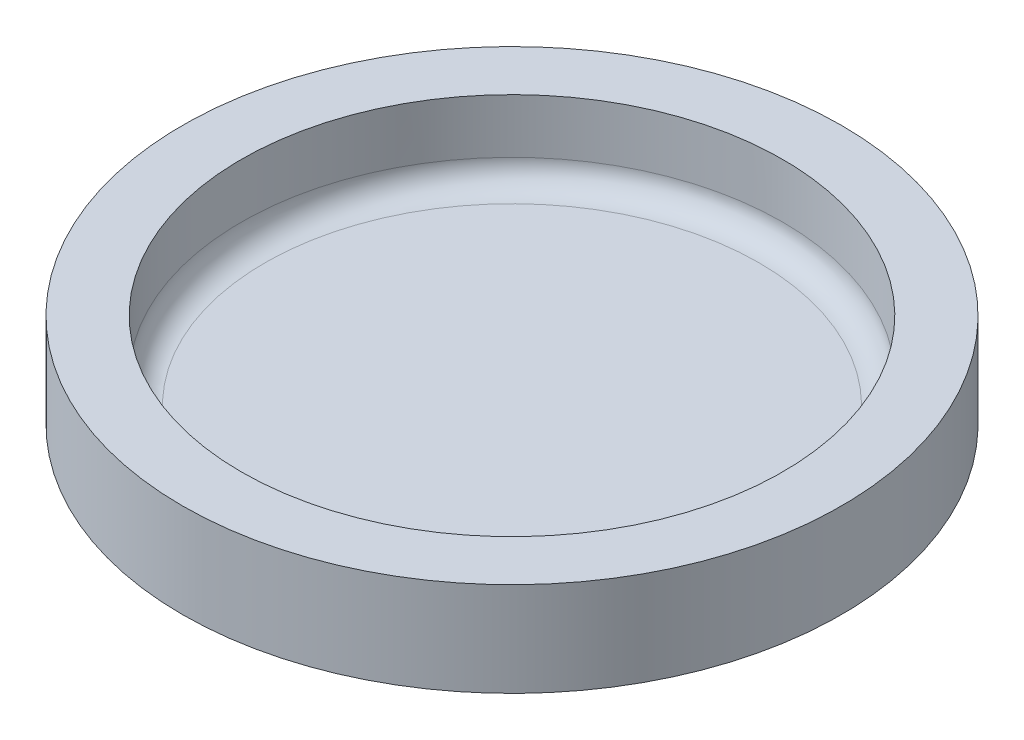
ISO-10303-21;
HEADER;
FILE_DESCRIPTION(('STEP AP214'),'2;1');
FILE_NAME('part.step','',(''),(''),'','','');
FILE_SCHEMA(('AUTOMOTIVE_DESIGN { 1 0 10303 214 1 1 1 1 }'));
ENDSEC;
DATA;
#1=APPLICATION_CONTEXT('core data for automotive mechanical design processes');
#2=APPLICATION_PROTOCOL_DEFINITION('international standard','automotive_design',2000,#1);
#3=PRODUCT_CONTEXT('',#1,'mechanical');
#4=PRODUCT('Part','Part','',(#3));
#5=PRODUCT_RELATED_PRODUCT_CATEGORY('part','',(#4));
#6=PRODUCT_DEFINITION_FORMATION('','',#4);
#7=PRODUCT_DEFINITION_CONTEXT('part definition',#1,'design');
#8=PRODUCT_DEFINITION('design','',#6,#7);
#9=PRODUCT_DEFINITION_SHAPE('','',#8);
#10=(LENGTH_UNIT() NAMED_UNIT(*) SI_UNIT(.MILLI.,.METRE.));
#11=(NAMED_UNIT(*) PLANE_ANGLE_UNIT() SI_UNIT($,.RADIAN.));
#12=(NAMED_UNIT(*) SI_UNIT($,.STERADIAN.) SOLID_ANGLE_UNIT());
#13=UNCERTAINTY_MEASURE_WITH_UNIT(LENGTH_MEASURE(1.E-05),#10,'distance_accuracy_value','');
#14=(GEOMETRIC_REPRESENTATION_CONTEXT(3) GLOBAL_UNCERTAINTY_ASSIGNED_CONTEXT((#13)) GLOBAL_UNIT_ASSIGNED_CONTEXT((#10,
#11,#12)) REPRESENTATION_CONTEXT('',''));
#15=CARTESIAN_POINT('',(0.,0.,0.));
#16=DIRECTION('',(0.,0.,1.));
#17=DIRECTION('',(1.,0.,0.));
#18=AXIS2_PLACEMENT_3D('',#15,#16,#17);
#19=CARTESIAN_POINT('',(0.,4.,0.));
#20=DIRECTION('',(0.,-1.,0.));
#21=DIRECTION('',(0.,0.,-1.));
#22=AXIS2_PLACEMENT_3D('',#19,#20,#21);
#23=CYLINDRICAL_SURFACE('',#22,14.);
#24=CARTESIAN_POINT('',(0.,4.,0.));
#25=DIRECTION('',(0.,1.,0.));
#26=DIRECTION('',(0.,0.,1.));
#27=AXIS2_PLACEMENT_3D('',#24,#25,#26);
#28=CIRCLE('',#27,14.);
#29=CARTESIAN_POINT('',(0.,4.,14.));
#30=VERTEX_POINT('',#29);
#31=EDGE_CURVE('E58',#30,#30,#28,.T.);
#32=ORIENTED_EDGE('',*,*,#31,.F.);
#33=EDGE_LOOP('',(#32));
#34=FACE_BOUND('',#33,.T.);
#35=CARTESIAN_POINT('',(0.,0.,0.));
#36=DIRECTION('',(0.,1.,0.));
#37=DIRECTION('',(0.,0.,1.));
#38=AXIS2_PLACEMENT_3D('',#35,#36,#37);
#39=CIRCLE('',#38,14.);
#40=CARTESIAN_POINT('',(0.,0.,14.));
#41=VERTEX_POINT('',#40);
#42=EDGE_CURVE('E63',#41,#41,#39,.T.);
#43=ORIENTED_EDGE('',*,*,#42,.T.);
#44=EDGE_LOOP('',(#43));
#45=FACE_BOUND('',#44,.T.);
#46=ADVANCED_FACE('F45',(#34,#45),#23,.T.);
#47=CARTESIAN_POINT('',(0.,4.,0.));
#48=DIRECTION('',(0.,1.,0.));
#49=DIRECTION('',(0.,0.,1.));
#50=AXIS2_PLACEMENT_3D('',#47,#48,#49);
#51=PLANE('',#50);
#52=CARTESIAN_POINT('',(0.,4.,0.));
#53=DIRECTION('',(0.,1.,0.));
#54=DIRECTION('',(0.,0.,1.));
#55=AXIS2_PLACEMENT_3D('',#52,#53,#54);
#56=CIRCLE('',#55,11.5);
#57=CARTESIAN_POINT('',(0.,4.,11.5));
#58=VERTEX_POINT('',#57);
#59=EDGE_CURVE('E68',#58,#58,#56,.T.);
#60=ORIENTED_EDGE('',*,*,#59,.F.);
#61=EDGE_LOOP('',(#60));
#62=FACE_BOUND('',#61,.T.);
#63=ORIENTED_EDGE('',*,*,#31,.T.);
#64=EDGE_LOOP('',(#63));
#65=FACE_BOUND('',#64,.T.);
#66=ADVANCED_FACE('F106',(#62,#65),#51,.T.);
#67=CARTESIAN_POINT('',(0.,0.,0.));
#68=DIRECTION('',(0.,1.,0.));
#69=DIRECTION('',(0.,0.,1.));
#70=AXIS2_PLACEMENT_3D('',#67,#68,#69);
#71=PLANE('',#70);
#72=ORIENTED_EDGE('',*,*,#42,.F.);
#73=EDGE_LOOP('',(#72));
#74=FACE_BOUND('',#73,.T.);
#75=ADVANCED_FACE('F109',(#74),#71,.F.);
#76=CARTESIAN_POINT('',(0.,0.692642259001709,0.));
#77=DIRECTION('',(0.,1.,0.));
#78=DIRECTION('',(0.,0.,1.));
#79=AXIS2_PLACEMENT_3D('',#76,#77,#78);
#80=CYLINDRICAL_SURFACE('',#79,11.5);
#81=CARTESIAN_POINT('',(0.,1.69264225900171,0.));
#82=DIRECTION('',(0.,-1.,0.));
#83=DIRECTION('',(0.,0.,-1.));
#84=AXIS2_PLACEMENT_3D('',#81,#82,#83);
#85=CIRCLE('',#84,11.5);
#86=CARTESIAN_POINT('',(0.,1.69264225900171,-11.5));
#87=VERTEX_POINT('',#86);
#88=EDGE_CURVE('E12',#87,#87,#85,.T.);
#89=ORIENTED_EDGE('',*,*,#88,.T.);
#90=EDGE_LOOP('',(#89));
#91=FACE_BOUND('',#90,.T.);
#92=ORIENTED_EDGE('',*,*,#59,.T.);
#93=EDGE_LOOP('',(#92));
#94=FACE_BOUND('',#93,.T.);
#95=ADVANCED_FACE('F104',(#91,#94),#80,.F.);
#96=CARTESIAN_POINT('',(11.5,0.692642259001709,0.));
#97=DIRECTION('',(0.,-1.,0.));
#98=DIRECTION('',(0.,0.,-1.));
#99=AXIS2_PLACEMENT_3D('',#96,#97,#98);
#100=PLANE('',#99);
#101=CARTESIAN_POINT('',(0.,0.692642259001709,0.));
#102=DIRECTION('',(0.,-1.,0.));
#103=DIRECTION('',(0.,0.,-1.));
#104=AXIS2_PLACEMENT_3D('',#101,#102,#103);
#105=CIRCLE('',#104,10.5);
#106=CARTESIAN_POINT('',(0.,0.692642259001709,-10.5));
#107=VERTEX_POINT('',#106);
#108=EDGE_CURVE('E53',#107,#107,#105,.F.);
#109=ORIENTED_EDGE('',*,*,#108,.T.);
#110=EDGE_LOOP('',(#109));
#111=FACE_BOUND('',#110,.T.);
#112=ADVANCED_FACE('F122',(#111),#100,.F.);
#113=CARTESIAN_POINT('',(0.,1.69264225900171,0.));
#114=DIRECTION('',(0.,-1.,0.));
#115=DIRECTION('',(0.,0.,-1.));
#116=AXIS2_PLACEMENT_3D('',#113,#114,#115);
#117=TOROIDAL_SURFACE('',#116,10.5,1.);
#118=ORIENTED_EDGE('',*,*,#88,.F.);
#119=EDGE_LOOP('',(#118));
#120=FACE_BOUND('',#119,.T.);
#121=ORIENTED_EDGE('',*,*,#108,.F.);
#122=EDGE_LOOP('',(#121));
#123=FACE_BOUND('',#122,.T.);
#124=ADVANCED_FACE('F47',(#120,#123),#117,.F.);
#125=CLOSED_SHELL('',(#46,#66,#75,#95,#112,#124));
#126=MANIFOLD_SOLID_BREP('B2',#125);
#127=ADVANCED_BREP_SHAPE_REPRESENTATION('',(#18,#126),#14);
#128=SHAPE_DEFINITION_REPRESENTATION(#9,#127);
ENDSEC;
END-ISO-10303-21;
